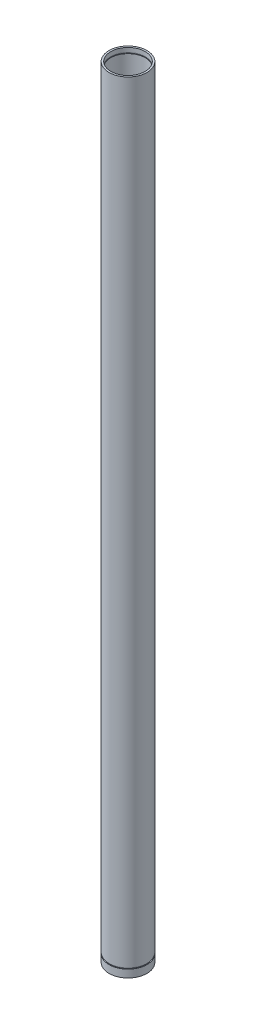
ISO-10303-21;
HEADER;
FILE_DESCRIPTION(('STEP AP214'),'2;1');
FILE_NAME('part.step','',(''),(''),'','','');
FILE_SCHEMA(('AUTOMOTIVE_DESIGN { 1 0 10303 214 1 1 1 1 }'));
ENDSEC;
DATA;
#1=APPLICATION_CONTEXT('core data for automotive mechanical design processes');
#2=APPLICATION_PROTOCOL_DEFINITION('international standard','automotive_design',2000,#1);
#3=PRODUCT_CONTEXT('',#1,'mechanical');
#4=PRODUCT('Part','Part','',(#3));
#5=PRODUCT_RELATED_PRODUCT_CATEGORY('part','',(#4));
#6=PRODUCT_DEFINITION_FORMATION('','',#4);
#7=PRODUCT_DEFINITION_CONTEXT('part definition',#1,'design');
#8=PRODUCT_DEFINITION('design','',#6,#7);
#9=PRODUCT_DEFINITION_SHAPE('','',#8);
#10=(LENGTH_UNIT() NAMED_UNIT(*) SI_UNIT(.MILLI.,.METRE.));
#11=(NAMED_UNIT(*) PLANE_ANGLE_UNIT() SI_UNIT($,.RADIAN.));
#12=(NAMED_UNIT(*) SI_UNIT($,.STERADIAN.) SOLID_ANGLE_UNIT());
#13=UNCERTAINTY_MEASURE_WITH_UNIT(LENGTH_MEASURE(1.E-05),#10,'distance_accuracy_value','');
#14=(GEOMETRIC_REPRESENTATION_CONTEXT(3) GLOBAL_UNCERTAINTY_ASSIGNED_CONTEXT((#13)) GLOBAL_UNIT_ASSIGNED_CONTEXT((#10,
#11,#12)) REPRESENTATION_CONTEXT('',''));
#15=CARTESIAN_POINT('',(0.,0.,0.));
#16=DIRECTION('',(0.,0.,1.));
#17=DIRECTION('',(1.,0.,0.));
#18=AXIS2_PLACEMENT_3D('',#15,#16,#17);
#19=CARTESIAN_POINT('',(0.,1111.25,0.));
#20=DIRECTION('',(0.,-1.,0.));
#21=DIRECTION('',(0.,0.,-1.));
#22=AXIS2_PLACEMENT_3D('',#19,#20,#21);
#23=CYLINDRICAL_SURFACE('',#22,27.051);
#24=CARTESIAN_POINT('',(0.,1111.25,0.));
#25=DIRECTION('',(0.,1.,0.));
#26=DIRECTION('',(0.,0.,1.));
#27=AXIS2_PLACEMENT_3D('',#24,#25,#26);
#28=CIRCLE('',#27,27.051);
#29=CARTESIAN_POINT('',(0.,1111.25,27.051));
#30=VERTEX_POINT('',#29);
#31=EDGE_CURVE('E10',#30,#30,#28,.T.);
#32=ORIENTED_EDGE('',*,*,#31,.F.);
#33=EDGE_LOOP('',(#32));
#34=FACE_BOUND('',#33,.T.);
#35=CARTESIAN_POINT('',(0.,12.446,0.));
#36=DIRECTION('',(0.,-1.,0.));
#37=DIRECTION('',(0.,0.,-1.));
#38=AXIS2_PLACEMENT_3D('',#35,#36,#37);
#39=CIRCLE('',#38,27.051);
#40=CARTESIAN_POINT('',(0.,12.446,-27.051));
#41=VERTEX_POINT('',#40);
#42=EDGE_CURVE('E50',#41,#41,#39,.T.);
#43=ORIENTED_EDGE('',*,*,#42,.F.);
#44=EDGE_LOOP('',(#43));
#45=FACE_BOUND('',#44,.T.);
#46=ADVANCED_FACE('F47',(#34,#45),#23,.T.);
#47=CARTESIAN_POINT('',(0.,0.,0.));
#48=DIRECTION('',(0.,1.,0.));
#49=DIRECTION('',(0.,0.,1.));
#50=AXIS2_PLACEMENT_3D('',#47,#48,#49);
#51=CIRCLE('',#50,27.051);
#52=CARTESIAN_POINT('',(0.,0.,27.051));
#53=VERTEX_POINT('',#52);
#54=EDGE_CURVE('E55',#53,#53,#51,.T.);
#55=ORIENTED_EDGE('',*,*,#54,.T.);
#56=EDGE_LOOP('',(#55));
#57=FACE_BOUND('',#56,.T.);
#58=CARTESIAN_POINT('',(0.,10.9220000000001,0.));
#59=DIRECTION('',(0.,1.,0.));
#60=DIRECTION('',(0.,0.,1.));
#61=AXIS2_PLACEMENT_3D('',#58,#59,#60);
#62=CIRCLE('',#61,27.051);
#63=CARTESIAN_POINT('',(0.,10.9220000000001,27.051));
#64=VERTEX_POINT('',#63);
#65=EDGE_CURVE('E86',#64,#64,#62,.T.);
#66=ORIENTED_EDGE('',*,*,#65,.F.);
#67=EDGE_LOOP('',(#66));
#68=FACE_BOUND('',#67,.T.);
#69=ADVANCED_FACE('F152',(#57,#68),#23,.T.);
#70=CARTESIAN_POINT('',(0.,1111.25,0.));
#71=DIRECTION('',(0.,-1.,0.));
#72=DIRECTION('',(0.,0.,-1.));
#73=AXIS2_PLACEMENT_3D('',#70,#71,#72);
#74=CYLINDRICAL_SURFACE('',#73,24.511);
#75=CARTESIAN_POINT('',(0.,1111.25,0.));
#76=DIRECTION('',(0.,1.,0.));
#77=DIRECTION('',(0.,0.,1.));
#78=AXIS2_PLACEMENT_3D('',#75,#76,#77);
#79=CIRCLE('',#78,24.511);
#80=CARTESIAN_POINT('',(0.,1111.25,24.511));
#81=VERTEX_POINT('',#80);
#82=EDGE_CURVE('E62',#81,#81,#79,.T.);
#83=ORIENTED_EDGE('',*,*,#82,.T.);
#84=EDGE_LOOP('',(#83));
#85=FACE_BOUND('',#84,.T.);
#86=CARTESIAN_POINT('',(0.,1105.027,0.));
#87=DIRECTION('',(0.,-1.,0.));
#88=DIRECTION('',(0.,0.,-1.));
#89=AXIS2_PLACEMENT_3D('',#86,#87,#88);
#90=CIRCLE('',#89,24.511);
#91=CARTESIAN_POINT('',(0.,1105.027,-24.511));
#92=VERTEX_POINT('',#91);
#93=EDGE_CURVE('E81',#92,#92,#90,.T.);
#94=ORIENTED_EDGE('',*,*,#93,.T.);
#95=EDGE_LOOP('',(#94));
#96=FACE_BOUND('',#95,.T.);
#97=ADVANCED_FACE('F131',(#85,#96),#74,.F.);
#98=CARTESIAN_POINT('',(0.,7.61999999999996,0.));
#99=DIRECTION('',(0.,-1.,0.));
#100=DIRECTION('',(0.,0.,-1.));
#101=AXIS2_PLACEMENT_3D('',#98,#99,#100);
#102=CIRCLE('',#101,24.511);
#103=CARTESIAN_POINT('',(0.,7.61999999999996,-24.511));
#104=VERTEX_POINT('',#103);
#105=EDGE_CURVE('E68',#104,#104,#102,.T.);
#106=ORIENTED_EDGE('',*,*,#105,.T.);
#107=EDGE_LOOP('',(#106));
#108=FACE_BOUND('',#107,.T.);
#109=CARTESIAN_POINT('',(0.,1103.63,0.));
#110=DIRECTION('',(0.,1.,0.));
#111=DIRECTION('',(0.,0.,1.));
#112=AXIS2_PLACEMENT_3D('',#109,#110,#111);
#113=CIRCLE('',#112,24.511);
#114=CARTESIAN_POINT('',(0.,1103.63,24.511));
#115=VERTEX_POINT('',#114);
#116=EDGE_CURVE('E77',#115,#115,#113,.T.);
#117=ORIENTED_EDGE('',*,*,#116,.T.);
#118=EDGE_LOOP('',(#117));
#119=FACE_BOUND('',#118,.T.);
#120=ADVANCED_FACE('F129',(#108,#119),#74,.F.);
#121=CARTESIAN_POINT('',(0.,0.,0.));
#122=DIRECTION('',(0.,1.,0.));
#123=DIRECTION('',(0.,0.,1.));
#124=AXIS2_PLACEMENT_3D('',#121,#122,#123);
#125=CIRCLE('',#124,24.511);
#126=CARTESIAN_POINT('',(0.,0.,24.511));
#127=VERTEX_POINT('',#126);
#128=EDGE_CURVE('E65',#127,#127,#125,.T.);
#129=ORIENTED_EDGE('',*,*,#128,.F.);
#130=EDGE_LOOP('',(#129));
#131=FACE_BOUND('',#130,.T.);
#132=CARTESIAN_POINT('',(0.,6.22300000000009,0.));
#133=DIRECTION('',(0.,1.,0.));
#134=DIRECTION('',(0.,0.,1.));
#135=AXIS2_PLACEMENT_3D('',#132,#133,#134);
#136=CIRCLE('',#135,24.511);
#137=CARTESIAN_POINT('',(0.,6.22300000000009,24.511));
#138=VERTEX_POINT('',#137);
#139=EDGE_CURVE('E72',#138,#138,#136,.T.);
#140=ORIENTED_EDGE('',*,*,#139,.T.);
#141=EDGE_LOOP('',(#140));
#142=FACE_BOUND('',#141,.T.);
#143=ADVANCED_FACE('F125',(#131,#142),#74,.F.);
#144=CARTESIAN_POINT('',(0.,1111.25,0.));
#145=DIRECTION('',(0.,1.,0.));
#146=DIRECTION('',(0.,0.,1.));
#147=AXIS2_PLACEMENT_3D('',#144,#145,#146);
#148=PLANE('',#147);
#149=ORIENTED_EDGE('',*,*,#31,.T.);
#150=EDGE_LOOP('',(#149));
#151=FACE_BOUND('',#150,.T.);
#152=ORIENTED_EDGE('',*,*,#82,.F.);
#153=EDGE_LOOP('',(#152));
#154=FACE_BOUND('',#153,.T.);
#155=ADVANCED_FACE('F128',(#151,#154),#148,.T.);
#156=CARTESIAN_POINT('',(0.,0.,0.));
#157=DIRECTION('',(0.,1.,0.));
#158=DIRECTION('',(0.,0.,1.));
#159=AXIS2_PLACEMENT_3D('',#156,#157,#158);
#160=PLANE('',#159);
#161=ORIENTED_EDGE('',*,*,#54,.F.);
#162=EDGE_LOOP('',(#161));
#163=FACE_BOUND('',#162,.T.);
#164=ORIENTED_EDGE('',*,*,#128,.T.);
#165=EDGE_LOOP('',(#164));
#166=FACE_BOUND('',#165,.T.);
#167=ADVANCED_FACE('F123',(#163,#166),#160,.F.);
#168=CARTESIAN_POINT('',(22.733,6.223,0.));
#169=DIRECTION('',(0.,1.,0.));
#170=DIRECTION('',(0.,0.,1.));
#171=AXIS2_PLACEMENT_3D('',#168,#169,#170);
#172=PLANE('',#171);
#173=ORIENTED_EDGE('',*,*,#139,.F.);
#174=EDGE_LOOP('',(#173));
#175=FACE_BOUND('',#174,.T.);
#176=CARTESIAN_POINT('',(0.,6.22300000000009,0.));
#177=DIRECTION('',(0.,1.,0.));
#178=DIRECTION('',(0.,0.,1.));
#179=AXIS2_PLACEMENT_3D('',#176,#177,#178);
#180=CIRCLE('',#179,25.273);
#181=CARTESIAN_POINT('',(0.,6.22300000000009,25.273));
#182=VERTEX_POINT('',#181);
#183=EDGE_CURVE('E73',#182,#182,#180,.T.);
#184=ORIENTED_EDGE('',*,*,#183,.T.);
#185=EDGE_LOOP('',(#184));
#186=FACE_BOUND('',#185,.T.);
#187=ADVANCED_FACE('F134',(#175,#186),#172,.T.);
#188=CARTESIAN_POINT('',(0.,1111.25,0.));
#189=DIRECTION('',(0.,1.,0.));
#190=DIRECTION('',(0.,0.,1.));
#191=AXIS2_PLACEMENT_3D('',#188,#189,#190);
#192=CYLINDRICAL_SURFACE('',#191,25.273);
#193=CARTESIAN_POINT('',(0.,7.61999999999996,0.));
#194=DIRECTION('',(0.,1.,0.));
#195=DIRECTION('',(0.,0.,1.));
#196=AXIS2_PLACEMENT_3D('',#193,#194,#195);
#197=CIRCLE('',#196,25.273);
#198=CARTESIAN_POINT('',(0.,7.61999999999996,25.273));
#199=VERTEX_POINT('',#198);
#200=EDGE_CURVE('E85',#199,#199,#197,.T.);
#201=ORIENTED_EDGE('',*,*,#200,.T.);
#202=EDGE_LOOP('',(#201));
#203=FACE_BOUND('',#202,.T.);
#204=ORIENTED_EDGE('',*,*,#183,.F.);
#205=EDGE_LOOP('',(#204));
#206=FACE_BOUND('',#205,.T.);
#207=ADVANCED_FACE('F137',(#203,#206),#192,.F.);
#208=CARTESIAN_POINT('',(22.733,7.62,0.));
#209=DIRECTION('',(0.,-1.,0.));
#210=DIRECTION('',(0.,0.,-1.));
#211=AXIS2_PLACEMENT_3D('',#208,#209,#210);
#212=PLANE('',#211);
#213=ORIENTED_EDGE('',*,*,#105,.F.);
#214=EDGE_LOOP('',(#213));
#215=FACE_BOUND('',#214,.T.);
#216=ORIENTED_EDGE('',*,*,#200,.F.);
#217=EDGE_LOOP('',(#216));
#218=FACE_BOUND('',#217,.T.);
#219=ADVANCED_FACE('F142',(#215,#218),#212,.T.);
#220=CARTESIAN_POINT('',(22.733,1105.027,0.));
#221=DIRECTION('',(0.,-1.,0.));
#222=DIRECTION('',(0.,0.,1.));
#223=AXIS2_PLACEMENT_3D('',#220,#221,#222);
#224=PLANE('',#223);
#225=ORIENTED_EDGE('',*,*,#93,.F.);
#226=EDGE_LOOP('',(#225));
#227=FACE_BOUND('',#226,.T.);
#228=CARTESIAN_POINT('',(0.,1105.027,0.));
#229=DIRECTION('',(0.,1.,0.));
#230=DIRECTION('',(0.,0.,1.));
#231=AXIS2_PLACEMENT_3D('',#228,#229,#230);
#232=CIRCLE('',#231,25.273);
#233=CARTESIAN_POINT('',(0.,1105.027,25.273));
#234=VERTEX_POINT('',#233);
#235=EDGE_CURVE('E82',#234,#234,#232,.T.);
#236=ORIENTED_EDGE('',*,*,#235,.F.);
#237=EDGE_LOOP('',(#236));
#238=FACE_BOUND('',#237,.T.);
#239=ADVANCED_FACE('F148',(#227,#238),#224,.T.);
#240=CARTESIAN_POINT('',(0.,0.,0.));
#241=DIRECTION('',(0.,-1.,0.));
#242=DIRECTION('',(0.,0.,1.));
#243=AXIS2_PLACEMENT_3D('',#240,#241,#242);
#244=CYLINDRICAL_SURFACE('',#243,25.273);
#245=CARTESIAN_POINT('',(0.,1103.63,0.));
#246=DIRECTION('',(0.,1.,0.));
#247=DIRECTION('',(0.,0.,1.));
#248=AXIS2_PLACEMENT_3D('',#245,#246,#247);
#249=CIRCLE('',#248,25.273);
#250=CARTESIAN_POINT('',(0.,1103.63,25.273));
#251=VERTEX_POINT('',#250);
#252=EDGE_CURVE('E96',#251,#251,#249,.T.);
#253=ORIENTED_EDGE('',*,*,#252,.F.);
#254=EDGE_LOOP('',(#253));
#255=FACE_BOUND('',#254,.T.);
#256=ORIENTED_EDGE('',*,*,#235,.T.);
#257=EDGE_LOOP('',(#256));
#258=FACE_BOUND('',#257,.T.);
#259=ADVANCED_FACE('F174',(#255,#258),#244,.F.);
#260=CARTESIAN_POINT('',(22.733,1103.63,0.));
#261=DIRECTION('',(0.,1.,0.));
#262=DIRECTION('',(0.,0.,-1.));
#263=AXIS2_PLACEMENT_3D('',#260,#261,#262);
#264=PLANE('',#263);
#265=ORIENTED_EDGE('',*,*,#116,.F.);
#266=EDGE_LOOP('',(#265));
#267=FACE_BOUND('',#266,.T.);
#268=ORIENTED_EDGE('',*,*,#252,.T.);
#269=EDGE_LOOP('',(#268));
#270=FACE_BOUND('',#269,.T.);
#271=ADVANCED_FACE('F164',(#267,#270),#264,.T.);
#272=CARTESIAN_POINT('',(27.704741037552,12.446,0.));
#273=DIRECTION('',(0.,-1.,0.));
#274=DIRECTION('',(0.,0.,-1.));
#275=AXIS2_PLACEMENT_3D('',#272,#273,#274);
#276=PLANE('',#275);
#277=CARTESIAN_POINT('',(0.,12.446,0.));
#278=DIRECTION('',(0.,1.,0.));
#279=DIRECTION('',(0.,0.,1.));
#280=AXIS2_PLACEMENT_3D('',#277,#278,#279);
#281=CIRCLE('',#280,25.908);
#282=CARTESIAN_POINT('',(0.,12.446,25.908));
#283=VERTEX_POINT('',#282);
#284=EDGE_CURVE('E89',#283,#283,#281,.T.);
#285=ORIENTED_EDGE('',*,*,#284,.T.);
#286=EDGE_LOOP('',(#285));
#287=FACE_BOUND('',#286,.T.);
#288=ORIENTED_EDGE('',*,*,#42,.T.);
#289=EDGE_LOOP('',(#288));
#290=FACE_BOUND('',#289,.T.);
#291=ADVANCED_FACE('F161',(#287,#290),#276,.T.);
#292=CARTESIAN_POINT('',(27.704741037552,10.922,0.));
#293=DIRECTION('',(0.,1.,0.));
#294=DIRECTION('',(0.,0.,1.));
#295=AXIS2_PLACEMENT_3D('',#292,#293,#294);
#296=PLANE('',#295);
#297=CARTESIAN_POINT('',(0.,10.9220000000001,0.));
#298=DIRECTION('',(0.,1.,0.));
#299=DIRECTION('',(0.,0.,1.));
#300=AXIS2_PLACEMENT_3D('',#297,#298,#299);
#301=CIRCLE('',#300,25.908);
#302=CARTESIAN_POINT('',(0.,10.9220000000001,25.908));
#303=VERTEX_POINT('',#302);
#304=EDGE_CURVE('E99',#303,#303,#301,.T.);
#305=ORIENTED_EDGE('',*,*,#304,.F.);
#306=EDGE_LOOP('',(#305));
#307=FACE_BOUND('',#306,.T.);
#308=ORIENTED_EDGE('',*,*,#65,.T.);
#309=EDGE_LOOP('',(#308));
#310=FACE_BOUND('',#309,.T.);
#311=ADVANCED_FACE('F163',(#307,#310),#296,.T.);
#312=CARTESIAN_POINT('',(0.,1111.25,0.));
#313=DIRECTION('',(0.,1.,0.));
#314=DIRECTION('',(0.,0.,1.));
#315=AXIS2_PLACEMENT_3D('',#312,#313,#314);
#316=CYLINDRICAL_SURFACE('',#315,25.908);
#317=ORIENTED_EDGE('',*,*,#304,.T.);
#318=EDGE_LOOP('',(#317));
#319=FACE_BOUND('',#318,.T.);
#320=ORIENTED_EDGE('',*,*,#284,.F.);
#321=EDGE_LOOP('',(#320));
#322=FACE_BOUND('',#321,.T.);
#323=ADVANCED_FACE('F170',(#319,#322),#316,.T.);
#324=CLOSED_SHELL('',(#46,#69,#97,#120,#143,#155,#167,#187,#207,#219,#239,#259,#271,#291,#311,#323));
#325=MANIFOLD_SOLID_BREP('B2',#324);
#326=ADVANCED_BREP_SHAPE_REPRESENTATION('',(#18,#325),#14);
#327=SHAPE_DEFINITION_REPRESENTATION(#9,#326);
ENDSEC;
END-ISO-10303-21;
